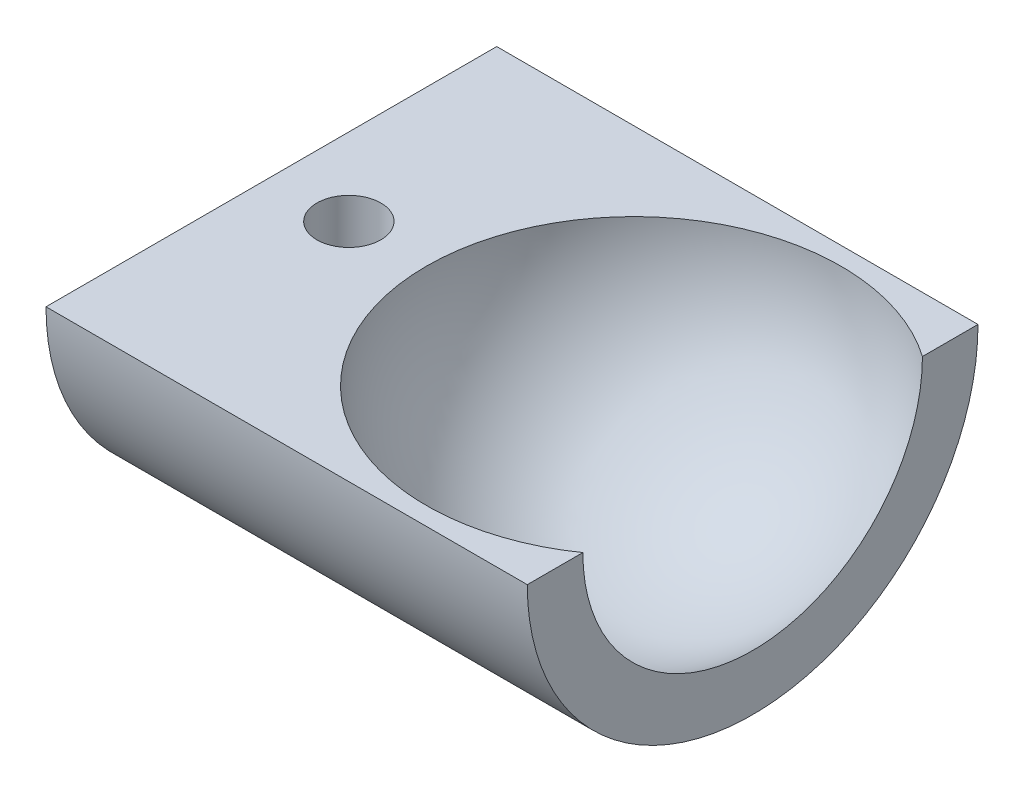
ISO-10303-21;
HEADER;
FILE_DESCRIPTION(('STEP AP214'),'2;1');
FILE_NAME('part.step','',(''),(''),'','','');
FILE_SCHEMA(('AUTOMOTIVE_DESIGN { 1 0 10303 214 1 1 1 1 }'));
ENDSEC;
DATA;
#1=APPLICATION_CONTEXT('core data for automotive mechanical design processes');
#2=APPLICATION_PROTOCOL_DEFINITION('international standard','automotive_design',2000,#1);
#3=PRODUCT_CONTEXT('',#1,'mechanical');
#4=PRODUCT('Part','Part','',(#3));
#5=PRODUCT_RELATED_PRODUCT_CATEGORY('part','',(#4));
#6=PRODUCT_DEFINITION_FORMATION('','',#4);
#7=PRODUCT_DEFINITION_CONTEXT('part definition',#1,'design');
#8=PRODUCT_DEFINITION('design','',#6,#7);
#9=PRODUCT_DEFINITION_SHAPE('','',#8);
#10=(LENGTH_UNIT() NAMED_UNIT(*) SI_UNIT(.MILLI.,.METRE.));
#11=(NAMED_UNIT(*) PLANE_ANGLE_UNIT() SI_UNIT($,.RADIAN.));
#12=(NAMED_UNIT(*) SI_UNIT($,.STERADIAN.) SOLID_ANGLE_UNIT());
#13=UNCERTAINTY_MEASURE_WITH_UNIT(LENGTH_MEASURE(1.E-05),#10,'distance_accuracy_value','');
#14=(GEOMETRIC_REPRESENTATION_CONTEXT(3) GLOBAL_UNCERTAINTY_ASSIGNED_CONTEXT((#13)) GLOBAL_UNIT_ASSIGNED_CONTEXT((#10,
#11,#12)) REPRESENTATION_CONTEXT('',''));
#15=CARTESIAN_POINT('',(0.,0.,0.));
#16=DIRECTION('',(0.,0.,1.));
#17=DIRECTION('',(1.,0.,0.));
#18=AXIS2_PLACEMENT_3D('',#15,#16,#17);
#19=CARTESIAN_POINT('',(0.,0.,0.));
#20=DIRECTION('',(1.,0.,0.));
#21=DIRECTION('',(0.,0.,1.));
#22=AXIS2_PLACEMENT_3D('',#19,#20,#21);
#23=SPHERICAL_SURFACE('',#22,10.7);
#24=CARTESIAN_POINT('',(0.,0.,0.));
#25=DIRECTION('',(0.,-1.,0.));
#26=DIRECTION('',(0.,0.,-1.));
#27=AXIS2_PLACEMENT_3D('',#24,#25,#26);
#28=CIRCLE('',#27,10.7);
#29=CARTESIAN_POINT('',(6.13968185808791,0.,8.76323608500115));
#30=VERTEX_POINT('',#29);
#31=CARTESIAN_POINT('',(6.13968185808791,0.,-8.76323608500114));
#32=VERTEX_POINT('',#31);
#33=EDGE_CURVE('E81',#30,#32,#28,.T.);
#34=ORIENTED_EDGE('',*,*,#33,.F.);
#35=CARTESIAN_POINT('',(6.13968185808791,0.,0.));
#36=DIRECTION('',(1.,0.,0.));
#37=DIRECTION('',(0.,0.,-1.));
#38=AXIS2_PLACEMENT_3D('',#35,#36,#37);
#39=CIRCLE('',#38,8.76323608500115);
#40=EDGE_CURVE('E39',#30,#32,#39,.T.);
#41=ORIENTED_EDGE('',*,*,#40,.T.);
#42=EDGE_LOOP('',(#34,#41));
#43=FACE_BOUND('',#42,.T.);
#44=ADVANCED_FACE('F32',(#43),#23,.F.);
#45=CARTESIAN_POINT('',(6.13968185808791,0.,-11.630777084451));
#46=DIRECTION('',(1.,0.,0.));
#47=DIRECTION('',(0.,0.,-1.));
#48=AXIS2_PLACEMENT_3D('',#45,#46,#47);
#49=PLANE('',#48);
#50=DIRECTION('',(0.,0.,-1.));
#51=VECTOR('',#50,1.);
#52=CARTESIAN_POINT('',(6.13968185808791,0.,0.));
#53=LINE('',#52,#51);
#54=CARTESIAN_POINT('',(6.1396818580879,0.,11.630777084451));
#55=VERTEX_POINT('',#54);
#56=EDGE_CURVE('E62',#55,#30,#53,.T.);
#57=ORIENTED_EDGE('',*,*,#56,.F.);
#58=CARTESIAN_POINT('',(6.13968185808791,0.,0.));
#59=DIRECTION('',(1.,0.,0.));
#60=DIRECTION('',(0.,0.,-1.));
#61=AXIS2_PLACEMENT_3D('',#58,#59,#60);
#62=CIRCLE('',#61,11.630777084451);
#63=CARTESIAN_POINT('',(6.13968185808791,0.,-11.6307770844509));
#64=VERTEX_POINT('',#63);
#65=EDGE_CURVE('E74',#55,#64,#62,.T.);
#66=ORIENTED_EDGE('',*,*,#65,.T.);
#67=EDGE_CURVE('E76',#32,#64,#53,.T.);
#68=ORIENTED_EDGE('',*,*,#67,.F.);
#69=ORIENTED_EDGE('',*,*,#40,.F.);
#70=EDGE_LOOP('',(#57,#66,#68,#69));
#71=FACE_BOUND('',#70,.T.);
#72=ADVANCED_FACE('F72',(#71),#49,.T.);
#73=CARTESIAN_POINT('',(-10.7,0.,0.));
#74=DIRECTION('',(1.,0.,0.));
#75=DIRECTION('',(0.,0.,-1.));
#76=AXIS2_PLACEMENT_3D('',#73,#74,#75);
#77=CYLINDRICAL_SURFACE('',#76,11.630777084451);
#78=CARTESIAN_POINT('',(-14.7,-11.5131436014752,1.65));
#79=CARTESIAN_POINT('',(-14.7921795036995,-11.5131450755976,1.64999615139875));
#80=CARTESIAN_POINT('',(-14.884413935919,-11.514262619308,1.64224929682255));
#81=CARTESIAN_POINT('',(-15.0663081304148,-11.5186094809756,1.61147245388151));
#82=CARTESIAN_POINT('',(-15.155965226083,-11.5218409093631,1.58842719176914));
#83=CARTESIAN_POINT('',(-15.3300453201041,-11.530042338198,1.52775333928386));
#84=CARTESIAN_POINT('',(-15.4144721217888,-11.5350110574416,1.49013549358685));
#85=CARTESIAN_POINT('',(-15.5758018266567,-11.5461256907381,1.40140886341238));
#86=CARTESIAN_POINT('',(-15.6527058492986,-11.552271429236,1.3503020904102));
#87=CARTESIAN_POINT('',(-15.7973718580575,-11.5650969467687,1.23565648130057));
#88=CARTESIAN_POINT('',(-15.8650720572098,-11.5717798976854,1.17204002453725));
#89=CARTESIAN_POINT('',(-15.9888738004964,-11.5848984614876,1.03434836545711));
#90=CARTESIAN_POINT('',(-16.0449747283562,-11.5913340612164,0.96027260778455));
#91=CARTESIAN_POINT('',(-16.1442114031631,-11.6032657738701,0.803371595009324));
#92=CARTESIAN_POINT('',(-16.187290561408,-11.6087577427198,0.720510206729757));
#93=CARTESIAN_POINT('',(-16.2588979363061,-11.6181483516977,0.548637395598456));
#94=CARTESIAN_POINT('',(-16.2874268425099,-11.62204706733,0.459626264416037));
#95=CARTESIAN_POINT('',(-16.328937430814,-11.6277895240131,0.278615738011376));
#96=CARTESIAN_POINT('',(-16.3420223672195,-11.6296469070544,0.186640461539828));
#97=CARTESIAN_POINT('',(-16.3525939839784,-11.6311441210802,0.00178219766455529));
#98=CARTESIAN_POINT('',(-16.3500814441639,-11.630784062931,-0.091100744126511));
#99=CARTESIAN_POINT('',(-16.3296113494289,-11.6278979101363,-0.274433945945944));
#100=CARTESIAN_POINT('',(-16.311764865976,-11.6253873927488,-0.364896887607076));
#101=CARTESIAN_POINT('',(-16.2613075788058,-11.6184997841804,-0.541530859208404));
#102=CARTESIAN_POINT('',(-16.228696428263,-11.6141226491523,-0.627701788275485));
#103=CARTESIAN_POINT('',(-16.1495202967453,-11.6039667908844,-0.793644488889961));
#104=CARTESIAN_POINT('',(-16.1029081071601,-11.5981833386015,-0.873393434632529));
#105=CARTESIAN_POINT('',(-15.9970874672482,-11.5858602789073,-1.02397945921328));
#106=CARTESIAN_POINT('',(-15.9378782741876,-11.5793206269199,-1.09481601217437));
#107=CARTESIAN_POINT('',(-15.8079244348575,-11.5661474512316,-1.22622045788516));
#108=CARTESIAN_POINT('',(-15.7370828700095,-11.5595136078735,-1.28669250989572));
#109=CARTESIAN_POINT('',(-15.5862057520116,-11.5469560810087,-1.39490419289251));
#110=CARTESIAN_POINT('',(-15.5061701529729,-11.5410324010468,-1.44264376032522));
#111=CARTESIAN_POINT('',(-15.3390820034973,-11.5305660732162,-1.52404567520346));
#112=CARTESIAN_POINT('',(-15.2520249608818,-11.5260243184856,-1.55769892391854));
#113=CARTESIAN_POINT('',(-15.0734159538982,-11.5188524061756,-1.60988045368318));
#114=CARTESIAN_POINT('',(-14.9818642717586,-11.5162221287338,-1.62840968311934));
#115=CARTESIAN_POINT('',(-14.7977153518659,-11.513193460327,-1.64968731904185));
#116=CARTESIAN_POINT('',(-14.7051340768637,-11.5127759033853,-1.65257124603616));
#117=CARTESIAN_POINT('',(-14.5208096004337,-11.5141691387953,-1.64283531409403));
#118=CARTESIAN_POINT('',(-14.4290663759026,-11.5159798695299,-1.6302158838597));
#119=CARTESIAN_POINT('',(-14.2494373514103,-11.5216080927789,-1.58994611328881));
#120=CARTESIAN_POINT('',(-14.1615362580323,-11.5254166561636,-1.56236263478439));
#121=CARTESIAN_POINT('',(-13.9916057239403,-11.5346041001127,-1.49301706059995));
#122=CARTESIAN_POINT('',(-13.9095765449991,-11.5399830506314,-1.45125433327832));
#123=CARTESIAN_POINT('',(-13.75310889821,-11.551750618035,-1.35440753436905));
#124=CARTESIAN_POINT('',(-13.6787254771963,-11.5581458128536,-1.29923534081336));
#125=CARTESIAN_POINT('',(-13.5402252358512,-11.5712052015783,-1.17725895717423));
#126=CARTESIAN_POINT('',(-13.4761089333497,-11.577869409031,-1.1104541807473));
#127=CARTESIAN_POINT('',(-13.3594799271506,-11.5907754914384,-0.966513792974288));
#128=CARTESIAN_POINT('',(-13.3070567752555,-11.5970138689716,-0.889305262082146));
#129=CARTESIAN_POINT('',(-13.215924604827,-11.6083117804411,-0.727099347130169));
#130=CARTESIAN_POINT('',(-13.1772152440123,-11.6133713437983,-0.642102157533389));
#131=CARTESIAN_POINT('',(-13.114754221077,-11.6217261638267,-0.467017446109343));
#132=CARTESIAN_POINT('',(-13.0909526379853,-11.6250273032345,-0.376948025952281));
#133=CARTESIAN_POINT('',(-13.0588209390988,-11.6295179332124,-0.19404076545349));
#134=CARTESIAN_POINT('',(-13.0504899138076,-11.6307075479166,-0.101203088180495));
#135=CARTESIAN_POINT('',(-13.049556220969,-11.6308400758066,0.0837348333383505));
#136=CARTESIAN_POINT('',(-13.0568161726533,-11.6298026130432,0.175834399660801));
#137=CARTESIAN_POINT('',(-13.0865650891968,-11.6256369218004,0.357489511610062));
#138=CARTESIAN_POINT('',(-13.1090540197493,-11.6225086980308,0.447045062967374));
#139=CARTESIAN_POINT('',(-13.168575656205,-11.6145113085422,0.621038998127089));
#140=CARTESIAN_POINT('',(-13.2055998464733,-11.6096431623245,0.70548034476592));
#141=CARTESIAN_POINT('',(-13.2931265732096,-11.5987021200161,0.866973664799753));
#142=CARTESIAN_POINT('',(-13.3436294533737,-11.5926291932054,0.944025449698495));
#143=CARTESIAN_POINT('',(-13.4571808825394,-11.5798909370227,1.08925113893461));
#144=CARTESIAN_POINT('',(-13.520331182672,-11.5732210628678,1.15734509230554));
#145=CARTESIAN_POINT('',(-13.6571711294424,-11.5600752506913,1.28202040457776));
#146=CARTESIAN_POINT('',(-13.730863252037,-11.5535993586636,1.33859905129545));
#147=CARTESIAN_POINT('',(-13.8871249133185,-11.5415401394422,1.4388879532802));
#148=CARTESIAN_POINT('',(-13.9697369515826,-11.5359614316548,1.48253252671175));
#149=CARTESIAN_POINT('',(-14.1411562995489,-11.5263823039189,1.55526335499237));
#150=CARTESIAN_POINT('',(-14.2299569595534,-11.5223802197402,1.584364969655));
#151=CARTESIAN_POINT('',(-14.3826486017732,-11.5173484887277,1.62045316521754));
#152=CARTESIAN_POINT('',(-14.4455891104251,-11.5157798388008,1.63151663276625));
#153=CARTESIAN_POINT('',(-14.5723443034789,-11.5136768903632,1.64629134266361));
#154=CARTESIAN_POINT('',(-14.6361589783107,-11.5131425805381,1.65000266543674));
#155=CARTESIAN_POINT('',(-14.7,-11.5131436014752,1.65));
#156=B_SPLINE_CURVE_WITH_KNOTS('',3,(#78,#79,#80,#81,#82,#83,#84,#85,#86,#87,#88,#89,#90,#91,
#92,#93,#94,#95,#96,#97,#98,#99,#100,#101,#102,#103,#104,#105,#106,#107,#108,#109,#110,#111,
#112,#113,#114,#115,#116,#117,#118,#119,#120,#121,#122,#123,#124,#125,#126,#127,#128,#129,#130,
#131,#132,#133,#134,#135,#136,#137,#138,#139,#140,#141,#142,#143,#144,#145,#146,#147,#148,#149,
#150,#151,#152,#153,#154,#155),.UNSPECIFIED.,.T.,.F.,(4,2,2,2,2,2,2,2,2,2,2,2,2,2,2,2,2,2,2,2,2,
2,2,2,2,2,2,2,2,2,2,2,2,2,2,2,2,2,4),(0.,0.276305209732254,0.552886695005337,0.829264637823596,
1.10560139029371,1.38371018902178,1.66183376000282,1.94114914882242,2.22045129938504,
2.49787533711086,2.77528550448998,3.05070302946793,3.32612702440057,3.60249032054595,
3.87886991590956,4.15768143442204,4.43649434458147,4.71548707058505,4.99446230036046,
5.27101712591492,5.54756430428892,5.82288588108945,6.09821972422301,6.37541435226497,
6.65262295642402,6.93188675017025,7.21114357330659,7.4894601912461,7.76776044675078,
8.0436185117232,8.3194759552643,8.59517202541729,8.87087512627999,9.14889250681191,
9.42697529279332,9.70644694872481,9.98562280837266,10.1769863885698,10.3683478754455),.UNSPECIFIED.);
#157=CARTESIAN_POINT('',(-14.7,-11.5131436014752,1.65));
#158=VERTEX_POINT('',#157);
#159=EDGE_CURVE('E86',#158,#158,#156,.T.);
#160=ORIENTED_EDGE('',*,*,#159,.F.);
#161=EDGE_LOOP('',(#160));
#162=FACE_BOUND('',#161,.T.);
#163=DIRECTION('',(1.,0.,0.));
#164=VECTOR('',#163,1.);
#165=CARTESIAN_POINT('',(-10.7,0.,-11.630777084451));
#166=LINE('',#165,#164);
#167=CARTESIAN_POINT('',(-18.7,0.,-11.630777084451));
#168=VERTEX_POINT('',#167);
#169=EDGE_CURVE('E45',#64,#168,#166,.F.);
#170=ORIENTED_EDGE('',*,*,#169,.F.);
#171=ORIENTED_EDGE('',*,*,#65,.F.);
#172=DIRECTION('',(1.,0.,0.));
#173=VECTOR('',#172,1.);
#174=CARTESIAN_POINT('',(-10.7,0.,11.630777084451));
#175=LINE('',#174,#173);
#176=CARTESIAN_POINT('',(-18.7,0.,11.630777084451));
#177=VERTEX_POINT('',#176);
#178=EDGE_CURVE('E59',#177,#55,#175,.T.);
#179=ORIENTED_EDGE('',*,*,#178,.F.);
#180=CARTESIAN_POINT('',(-18.7,0.,0.));
#181=DIRECTION('',(1.,0.,0.));
#182=DIRECTION('',(0.,0.,-1.));
#183=AXIS2_PLACEMENT_3D('',#180,#181,#182);
#184=CIRCLE('',#183,11.630777084451);
#185=EDGE_CURVE('E79',#177,#168,#184,.T.);
#186=ORIENTED_EDGE('',*,*,#185,.T.);
#187=EDGE_LOOP('',(#170,#171,#179,#186));
#188=FACE_BOUND('',#187,.T.);
#189=ADVANCED_FACE('F78',(#162,#188),#77,.T.);
#190=CARTESIAN_POINT('',(-18.7,0.,-11.630777084451));
#191=DIRECTION('',(-1.,0.,0.));
#192=DIRECTION('',(0.,0.,1.));
#193=AXIS2_PLACEMENT_3D('',#190,#191,#192);
#194=PLANE('',#193);
#195=DIRECTION('',(0.,0.,1.));
#196=VECTOR('',#195,1.);
#197=CARTESIAN_POINT('',(-18.7,0.,-11.630777084451));
#198=LINE('',#197,#196);
#199=EDGE_CURVE('E11',#168,#177,#198,.T.);
#200=ORIENTED_EDGE('',*,*,#199,.F.);
#201=ORIENTED_EDGE('',*,*,#185,.F.);
#202=EDGE_LOOP('',(#200,#201));
#203=FACE_BOUND('',#202,.T.);
#204=ADVANCED_FACE('F102',(#203),#194,.T.);
#205=CARTESIAN_POINT('',(-43.8603181419121,0.,0.));
#206=DIRECTION('',(0.,-1.,0.));
#207=DIRECTION('',(0.,0.,-1.));
#208=AXIS2_PLACEMENT_3D('',#205,#206,#207);
#209=PLANE('',#208);
#210=CARTESIAN_POINT('',(-14.7,0.,0.));
#211=DIRECTION('',(0.,1.,0.));
#212=DIRECTION('',(0.,0.,1.));
#213=AXIS2_PLACEMENT_3D('',#210,#211,#212);
#214=CIRCLE('',#213,1.65);
#215=CARTESIAN_POINT('',(-14.7,0.,1.65));
#216=VERTEX_POINT('',#215);
#217=EDGE_CURVE('E93',#216,#216,#214,.T.);
#218=ORIENTED_EDGE('',*,*,#217,.F.);
#219=EDGE_LOOP('',(#218));
#220=FACE_BOUND('',#219,.T.);
#221=ORIENTED_EDGE('',*,*,#33,.T.);
#222=ORIENTED_EDGE('',*,*,#67,.T.);
#223=ORIENTED_EDGE('',*,*,#169,.T.);
#224=ORIENTED_EDGE('',*,*,#199,.T.);
#225=ORIENTED_EDGE('',*,*,#178,.T.);
#226=ORIENTED_EDGE('',*,*,#56,.T.);
#227=EDGE_LOOP('',(#221,#222,#223,#224,#225,#226));
#228=FACE_BOUND('',#227,.T.);
#229=ADVANCED_FACE('F61',(#220,#228),#209,.F.);
#230=CARTESIAN_POINT('',(-14.7,-50.,0.));
#231=DIRECTION('',(0.,1.,0.));
#232=DIRECTION('',(0.,0.,1.));
#233=AXIS2_PLACEMENT_3D('',#230,#231,#232);
#234=CYLINDRICAL_SURFACE('',#233,1.65);
#235=ORIENTED_EDGE('',*,*,#159,.T.);
#236=EDGE_LOOP('',(#235));
#237=FACE_BOUND('',#236,.T.);
#238=ORIENTED_EDGE('',*,*,#217,.T.);
#239=EDGE_LOOP('',(#238));
#240=FACE_BOUND('',#239,.T.);
#241=ADVANCED_FACE('F96',(#237,#240),#234,.F.);
#242=CLOSED_SHELL('',(#44,#72,#189,#204,#229,#241));
#243=MANIFOLD_SOLID_BREP('B2',#242);
#244=ADVANCED_BREP_SHAPE_REPRESENTATION('',(#18,#243),#14);
#245=SHAPE_DEFINITION_REPRESENTATION(#9,#244);
ENDSEC;
END-ISO-10303-21;
